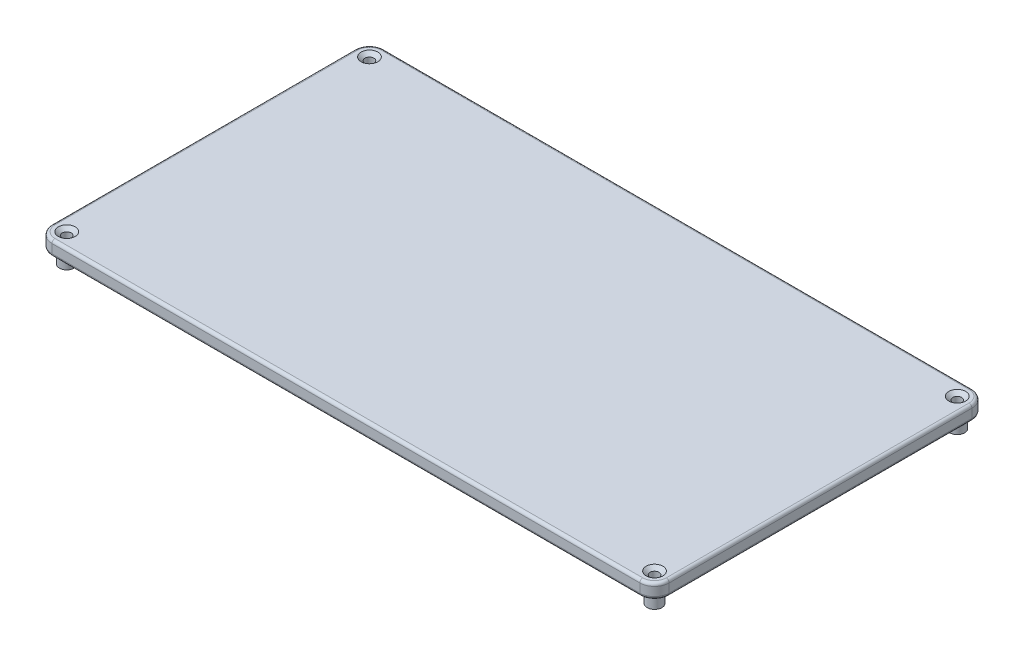
ISO-10303-21;
HEADER;
FILE_DESCRIPTION(('STEP AP214'),'2;1');
FILE_NAME('part.step','',(''),(''),'','','');
FILE_SCHEMA(('AUTOMOTIVE_DESIGN { 1 0 10303 214 1 1 1 1 }'));
ENDSEC;
DATA;
#1=APPLICATION_CONTEXT('core data for automotive mechanical design processes');
#2=APPLICATION_PROTOCOL_DEFINITION('international standard','automotive_design',2000,#1);
#3=PRODUCT_CONTEXT('',#1,'mechanical');
#4=PRODUCT('Part','Part','',(#3));
#5=PRODUCT_RELATED_PRODUCT_CATEGORY('part','',(#4));
#6=PRODUCT_DEFINITION_FORMATION('','',#4);
#7=PRODUCT_DEFINITION_CONTEXT('part definition',#1,'design');
#8=PRODUCT_DEFINITION('design','',#6,#7);
#9=PRODUCT_DEFINITION_SHAPE('','',#8);
#10=(LENGTH_UNIT() NAMED_UNIT(*) SI_UNIT(.MILLI.,.METRE.));
#11=(NAMED_UNIT(*) PLANE_ANGLE_UNIT() SI_UNIT($,.RADIAN.));
#12=(NAMED_UNIT(*) SI_UNIT($,.STERADIAN.) SOLID_ANGLE_UNIT());
#13=UNCERTAINTY_MEASURE_WITH_UNIT(LENGTH_MEASURE(1.E-05),#10,'distance_accuracy_value','');
#14=(GEOMETRIC_REPRESENTATION_CONTEXT(3) GLOBAL_UNCERTAINTY_ASSIGNED_CONTEXT((#13)) GLOBAL_UNIT_ASSIGNED_CONTEXT((#10,
#11,#12)) REPRESENTATION_CONTEXT('',''));
#15=CARTESIAN_POINT('',(0.,0.,0.));
#16=DIRECTION('',(0.,0.,1.));
#17=DIRECTION('',(1.,0.,0.));
#18=AXIS2_PLACEMENT_3D('',#15,#16,#17);
#19=CARTESIAN_POINT('',(105.,5.,56.5));
#20=DIRECTION('',(-1.,0.,0.));
#21=DIRECTION('',(0.,0.,1.));
#22=AXIS2_PLACEMENT_3D('',#19,#20,#21);
#23=PLANE('',#22);
#24=DIRECTION('',(0.,-1.,0.));
#25=VECTOR('',#24,1.);
#26=CARTESIAN_POINT('',(105.,5.,-51.5));
#27=LINE('',#26,#25);
#28=CARTESIAN_POINT('',(105.,1.,-51.5));
#29=VERTEX_POINT('',#28);
#30=CARTESIAN_POINT('',(105.,4.,-51.5));
#31=VERTEX_POINT('',#30);
#32=EDGE_CURVE('E280',#29,#31,#27,.F.);
#33=ORIENTED_EDGE('',*,*,#32,.T.);
#34=DIRECTION('',(0.,0.,-1.));
#35=VECTOR('',#34,1.);
#36=CARTESIAN_POINT('',(105.,4.,56.5));
#37=LINE('',#36,#35);
#38=CARTESIAN_POINT('',(105.,4.,51.5));
#39=VERTEX_POINT('',#38);
#40=EDGE_CURVE('E202',#31,#39,#37,.F.);
#41=ORIENTED_EDGE('',*,*,#40,.T.);
#42=DIRECTION('',(0.,-1.,0.));
#43=VECTOR('',#42,1.);
#44=CARTESIAN_POINT('',(105.,5.,51.5));
#45=LINE('',#44,#43);
#46=CARTESIAN_POINT('',(105.,1.,51.5));
#47=VERTEX_POINT('',#46);
#48=EDGE_CURVE('E169',#39,#47,#45,.T.);
#49=ORIENTED_EDGE('',*,*,#48,.T.);
#50=DIRECTION('',(0.,0.,-1.));
#51=VECTOR('',#50,1.);
#52=CARTESIAN_POINT('',(105.,1.,-51.5));
#53=LINE('',#52,#51);
#54=EDGE_CURVE('E200',#47,#29,#53,.T.);
#55=ORIENTED_EDGE('',*,*,#54,.T.);
#56=EDGE_LOOP('',(#33,#41,#49,#55));
#57=FACE_BOUND('',#56,.T.);
#58=ADVANCED_FACE('F32',(#57),#23,.F.);
#59=CARTESIAN_POINT('',(-105.,5.,-56.5));
#60=DIRECTION('',(0.,0.,1.));
#61=DIRECTION('',(1.,0.,0.));
#62=AXIS2_PLACEMENT_3D('',#59,#60,#61);
#63=PLANE('',#62);
#64=DIRECTION('',(0.,-1.,0.));
#65=VECTOR('',#64,1.);
#66=CARTESIAN_POINT('',(-100.,5.,-56.5));
#67=LINE('',#66,#65);
#68=CARTESIAN_POINT('',(-100.,1.,-56.5));
#69=VERTEX_POINT('',#68);
#70=CARTESIAN_POINT('',(-100.,4.,-56.5));
#71=VERTEX_POINT('',#70);
#72=EDGE_CURVE('E286',#69,#71,#67,.F.);
#73=ORIENTED_EDGE('',*,*,#72,.T.);
#74=DIRECTION('',(-1.,0.,0.));
#75=VECTOR('',#74,1.);
#76=CARTESIAN_POINT('',(-105.,4.,-56.5));
#77=LINE('',#76,#75);
#78=CARTESIAN_POINT('',(100.,4.,-56.5));
#79=VERTEX_POINT('',#78);
#80=EDGE_CURVE('E194',#71,#79,#77,.F.);
#81=ORIENTED_EDGE('',*,*,#80,.T.);
#82=DIRECTION('',(0.,-1.,0.));
#83=VECTOR('',#82,1.);
#84=CARTESIAN_POINT('',(100.,5.,-56.5));
#85=LINE('',#84,#83);
#86=CARTESIAN_POINT('',(100.,1.,-56.5));
#87=VERTEX_POINT('',#86);
#88=EDGE_CURVE('E277',#79,#87,#85,.T.);
#89=ORIENTED_EDGE('',*,*,#88,.T.);
#90=DIRECTION('',(-1.,0.,0.));
#91=VECTOR('',#90,1.);
#92=CARTESIAN_POINT('',(-100.,1.,-56.5));
#93=LINE('',#92,#91);
#94=EDGE_CURVE('E192',#87,#69,#93,.T.);
#95=ORIENTED_EDGE('',*,*,#94,.T.);
#96=EDGE_LOOP('',(#73,#81,#89,#95));
#97=FACE_BOUND('',#96,.T.);
#98=ADVANCED_FACE('F283',(#97),#63,.F.);
#99=CARTESIAN_POINT('',(-105.,5.,56.5));
#100=DIRECTION('',(1.,0.,0.));
#101=DIRECTION('',(0.,0.,-1.));
#102=AXIS2_PLACEMENT_3D('',#99,#100,#101);
#103=PLANE('',#102);
#104=DIRECTION('',(0.,-1.,0.));
#105=VECTOR('',#104,1.);
#106=CARTESIAN_POINT('',(-105.,5.,51.5));
#107=LINE('',#106,#105);
#108=CARTESIAN_POINT('',(-105.,1.,51.5));
#109=VERTEX_POINT('',#108);
#110=CARTESIAN_POINT('',(-105.,4.,51.5));
#111=VERTEX_POINT('',#110);
#112=EDGE_CURVE('E241',#109,#111,#107,.F.);
#113=ORIENTED_EDGE('',*,*,#112,.T.);
#114=DIRECTION('',(0.,0.,1.));
#115=VECTOR('',#114,1.);
#116=CARTESIAN_POINT('',(-105.,4.,56.5));
#117=LINE('',#116,#115);
#118=CARTESIAN_POINT('',(-105.,4.,-51.5));
#119=VERTEX_POINT('',#118);
#120=EDGE_CURVE('E186',#111,#119,#117,.F.);
#121=ORIENTED_EDGE('',*,*,#120,.T.);
#122=DIRECTION('',(0.,-1.,0.));
#123=VECTOR('',#122,1.);
#124=CARTESIAN_POINT('',(-105.,5.,-51.5));
#125=LINE('',#124,#123);
#126=CARTESIAN_POINT('',(-105.,1.,-51.5));
#127=VERTEX_POINT('',#126);
#128=EDGE_CURVE('E287',#119,#127,#125,.T.);
#129=ORIENTED_EDGE('',*,*,#128,.T.);
#130=DIRECTION('',(0.,0.,1.));
#131=VECTOR('',#130,1.);
#132=CARTESIAN_POINT('',(-105.,1.,51.5));
#133=LINE('',#132,#131);
#134=EDGE_CURVE('E184',#127,#109,#133,.T.);
#135=ORIENTED_EDGE('',*,*,#134,.T.);
#136=EDGE_LOOP('',(#113,#121,#129,#135));
#137=FACE_BOUND('',#136,.T.);
#138=ADVANCED_FACE('F326',(#137),#103,.F.);
#139=CARTESIAN_POINT('',(-105.,5.,56.5));
#140=DIRECTION('',(0.,0.,-1.));
#141=DIRECTION('',(-1.,0.,0.));
#142=AXIS2_PLACEMENT_3D('',#139,#140,#141);
#143=PLANE('',#142);
#144=DIRECTION('',(0.,-1.,0.));
#145=VECTOR('',#144,1.);
#146=CARTESIAN_POINT('',(100.,5.,56.5));
#147=LINE('',#146,#145);
#148=CARTESIAN_POINT('',(100.,1.,56.5));
#149=VERTEX_POINT('',#148);
#150=CARTESIAN_POINT('',(100.,4.,56.5));
#151=VERTEX_POINT('',#150);
#152=EDGE_CURVE('E289',#149,#151,#147,.F.);
#153=ORIENTED_EDGE('',*,*,#152,.T.);
#154=DIRECTION('',(1.,0.,0.));
#155=VECTOR('',#154,1.);
#156=CARTESIAN_POINT('',(-105.,4.,56.5));
#157=LINE('',#156,#155);
#158=CARTESIAN_POINT('',(-100.,4.,56.5));
#159=VERTEX_POINT('',#158);
#160=EDGE_CURVE('E11',#151,#159,#157,.F.);
#161=ORIENTED_EDGE('',*,*,#160,.T.);
#162=DIRECTION('',(0.,-1.,0.));
#163=VECTOR('',#162,1.);
#164=CARTESIAN_POINT('',(-100.,5.,56.5));
#165=LINE('',#164,#163);
#166=CARTESIAN_POINT('',(-100.,1.,56.5));
#167=VERTEX_POINT('',#166);
#168=EDGE_CURVE('E297',#159,#167,#165,.T.);
#169=ORIENTED_EDGE('',*,*,#168,.T.);
#170=DIRECTION('',(1.,0.,0.));
#171=VECTOR('',#170,1.);
#172=CARTESIAN_POINT('',(100.,1.,56.5));
#173=LINE('',#172,#171);
#174=EDGE_CURVE('E41',#167,#149,#173,.T.);
#175=ORIENTED_EDGE('',*,*,#174,.T.);
#176=EDGE_LOOP('',(#153,#161,#169,#175));
#177=FACE_BOUND('',#176,.T.);
#178=ADVANCED_FACE('F573',(#177),#143,.F.);
#179=CARTESIAN_POINT('',(0.,5.,0.));
#180=DIRECTION('',(0.,-1.,0.));
#181=DIRECTION('',(0.,0.,-1.));
#182=AXIS2_PLACEMENT_3D('',#179,#180,#181);
#183=PLANE('',#182);
#184=CARTESIAN_POINT('',(-100.,5.,51.5));
#185=DIRECTION('',(0.,1.,0.));
#186=DIRECTION('',(0.,0.,1.));
#187=AXIS2_PLACEMENT_3D('',#184,#185,#186);
#188=CIRCLE('',#187,2.8575);
#189=CARTESIAN_POINT('',(-100.,5.,54.3575));
#190=VERTEX_POINT('',#189);
#191=EDGE_CURVE('E337',#190,#190,#188,.T.);
#192=ORIENTED_EDGE('',*,*,#191,.F.);
#193=EDGE_LOOP('',(#192));
#194=FACE_BOUND('',#193,.T.);
#195=CARTESIAN_POINT('',(100.,5.,-51.5));
#196=DIRECTION('',(0.,1.,0.));
#197=DIRECTION('',(0.,0.,1.));
#198=AXIS2_PLACEMENT_3D('',#195,#196,#197);
#199=CIRCLE('',#198,2.8575);
#200=CARTESIAN_POINT('',(100.,5.,-48.6425));
#201=VERTEX_POINT('',#200);
#202=EDGE_CURVE('E334',#201,#201,#199,.T.);
#203=ORIENTED_EDGE('',*,*,#202,.F.);
#204=EDGE_LOOP('',(#203));
#205=FACE_BOUND('',#204,.T.);
#206=CARTESIAN_POINT('',(100.,5.,51.5));
#207=DIRECTION('',(0.,1.,0.));
#208=DIRECTION('',(0.,0.,1.));
#209=AXIS2_PLACEMENT_3D('',#206,#207,#208);
#210=CIRCLE('',#209,2.8575);
#211=CARTESIAN_POINT('',(100.,5.,54.3575));
#212=VERTEX_POINT('',#211);
#213=EDGE_CURVE('E331',#212,#212,#210,.T.);
#214=ORIENTED_EDGE('',*,*,#213,.F.);
#215=EDGE_LOOP('',(#214));
#216=FACE_BOUND('',#215,.T.);
#217=CARTESIAN_POINT('',(-100.,5.,-51.5));
#218=DIRECTION('',(0.,1.,0.));
#219=DIRECTION('',(0.,0.,1.));
#220=AXIS2_PLACEMENT_3D('',#217,#218,#219);
#221=CIRCLE('',#220,2.8575);
#222=CARTESIAN_POINT('',(-100.,5.,-48.6425));
#223=VERTEX_POINT('',#222);
#224=EDGE_CURVE('E244',#223,#223,#221,.T.);
#225=ORIENTED_EDGE('',*,*,#224,.F.);
#226=EDGE_LOOP('',(#225));
#227=FACE_BOUND('',#226,.T.);
#228=DIRECTION('',(0.,0.,1.));
#229=VECTOR('',#228,1.);
#230=CARTESIAN_POINT('',(-104.,5.,0.));
#231=LINE('',#230,#229);
#232=CARTESIAN_POINT('',(-104.,5.,-51.5));
#233=VERTEX_POINT('',#232);
#234=CARTESIAN_POINT('',(-104.,5.,51.5));
#235=VERTEX_POINT('',#234);
#236=EDGE_CURVE('E173',#233,#235,#231,.T.);
#237=ORIENTED_EDGE('',*,*,#236,.T.);
#238=CARTESIAN_POINT('',(-100.,5.,51.5));
#239=DIRECTION('',(0.,-1.,0.));
#240=DIRECTION('',(0.,0.,-1.));
#241=AXIS2_PLACEMENT_3D('',#238,#239,#240);
#242=CIRCLE('',#241,4.);
#243=CARTESIAN_POINT('',(-100.,5.,55.5));
#244=VERTEX_POINT('',#243);
#245=EDGE_CURVE('E153',#235,#244,#242,.F.);
#246=ORIENTED_EDGE('',*,*,#245,.T.);
#247=DIRECTION('',(1.,0.,0.));
#248=VECTOR('',#247,1.);
#249=CARTESIAN_POINT('',(0.,5.,55.5));
#250=LINE('',#249,#248);
#251=CARTESIAN_POINT('',(100.,5.,55.5));
#252=VERTEX_POINT('',#251);
#253=EDGE_CURVE('E162',#244,#252,#250,.T.);
#254=ORIENTED_EDGE('',*,*,#253,.T.);
#255=CARTESIAN_POINT('',(100.,5.,51.5));
#256=DIRECTION('',(0.,-1.,0.));
#257=DIRECTION('',(0.,0.,-1.));
#258=AXIS2_PLACEMENT_3D('',#255,#256,#257);
#259=CIRCLE('',#258,4.);
#260=CARTESIAN_POINT('',(104.,5.,51.5));
#261=VERTEX_POINT('',#260);
#262=EDGE_CURVE('E168',#252,#261,#259,.F.);
#263=ORIENTED_EDGE('',*,*,#262,.T.);
#264=DIRECTION('',(0.,0.,-1.));
#265=VECTOR('',#264,1.);
#266=CARTESIAN_POINT('',(104.,5.,0.));
#267=LINE('',#266,#265);
#268=CARTESIAN_POINT('',(104.,5.,-51.5));
#269=VERTEX_POINT('',#268);
#270=EDGE_CURVE('E304',#261,#269,#267,.T.);
#271=ORIENTED_EDGE('',*,*,#270,.T.);
#272=CARTESIAN_POINT('',(100.,5.,-51.5));
#273=DIRECTION('',(0.,-1.,0.));
#274=DIRECTION('',(0.,0.,-1.));
#275=AXIS2_PLACEMENT_3D('',#272,#273,#274);
#276=CIRCLE('',#275,4.);
#277=CARTESIAN_POINT('',(100.,5.,-55.5));
#278=VERTEX_POINT('',#277);
#279=EDGE_CURVE('E306',#269,#278,#276,.F.);
#280=ORIENTED_EDGE('',*,*,#279,.T.);
#281=DIRECTION('',(-1.,0.,0.));
#282=VECTOR('',#281,1.);
#283=CARTESIAN_POINT('',(0.,5.,-55.5));
#284=LINE('',#283,#282);
#285=CARTESIAN_POINT('',(-100.,5.,-55.5));
#286=VERTEX_POINT('',#285);
#287=EDGE_CURVE('E308',#278,#286,#284,.T.);
#288=ORIENTED_EDGE('',*,*,#287,.T.);
#289=CARTESIAN_POINT('',(-100.,5.,-51.5));
#290=DIRECTION('',(0.,-1.,0.));
#291=DIRECTION('',(0.,0.,-1.));
#292=AXIS2_PLACEMENT_3D('',#289,#290,#291);
#293=CIRCLE('',#292,4.);
#294=EDGE_CURVE('E179',#286,#233,#293,.F.);
#295=ORIENTED_EDGE('',*,*,#294,.T.);
#296=EDGE_LOOP('',(#237,#246,#254,#263,#271,#280,#288,#295));
#297=FACE_BOUND('',#296,.T.);
#298=ADVANCED_FACE('F171',(#194,#205,#216,#227,#297),#183,.F.);
#299=CARTESIAN_POINT('',(0.,0.,0.));
#300=DIRECTION('',(0.,-1.,0.));
#301=DIRECTION('',(0.,0.,-1.));
#302=AXIS2_PLACEMENT_3D('',#299,#300,#301);
#303=PLANE('',#302);
#304=CARTESIAN_POINT('',(100.,0.,-51.5));
#305=DIRECTION('',(0.,-1.,0.));
#306=DIRECTION('',(0.,0.,-1.));
#307=AXIS2_PLACEMENT_3D('',#304,#305,#306);
#308=CIRCLE('',#307,2.52499999999999);
#309=CARTESIAN_POINT('',(100.,0.,-54.025));
#310=VERTEX_POINT('',#309);
#311=EDGE_CURVE('E374',#310,#310,#308,.T.);
#312=ORIENTED_EDGE('',*,*,#311,.F.);
#313=EDGE_LOOP('',(#312));
#314=FACE_BOUND('',#313,.T.);
#315=CARTESIAN_POINT('',(100.,0.,51.5));
#316=DIRECTION('',(0.,-1.,0.));
#317=DIRECTION('',(0.,0.,-1.));
#318=AXIS2_PLACEMENT_3D('',#315,#316,#317);
#319=CIRCLE('',#318,2.52499999999999);
#320=CARTESIAN_POINT('',(100.,0.,48.975));
#321=VERTEX_POINT('',#320);
#322=EDGE_CURVE('E362',#321,#321,#319,.T.);
#323=ORIENTED_EDGE('',*,*,#322,.F.);
#324=EDGE_LOOP('',(#323));
#325=FACE_BOUND('',#324,.T.);
#326=CARTESIAN_POINT('',(-100.,0.,-51.5));
#327=DIRECTION('',(0.,-1.,0.));
#328=DIRECTION('',(0.,0.,-1.));
#329=AXIS2_PLACEMENT_3D('',#326,#327,#328);
#330=CIRCLE('',#329,2.52499999999999);
#331=CARTESIAN_POINT('',(-100.,0.,-54.025));
#332=VERTEX_POINT('',#331);
#333=EDGE_CURVE('E349',#332,#332,#330,.T.);
#334=ORIENTED_EDGE('',*,*,#333,.F.);
#335=EDGE_LOOP('',(#334));
#336=FACE_BOUND('',#335,.T.);
#337=CARTESIAN_POINT('',(-100.,0.,51.5));
#338=DIRECTION('',(0.,-1.,0.));
#339=DIRECTION('',(0.,0.,-1.));
#340=AXIS2_PLACEMENT_3D('',#337,#338,#339);
#341=CIRCLE('',#340,2.4732);
#342=CARTESIAN_POINT('',(-100.,0.,49.0268));
#343=VERTEX_POINT('',#342);
#344=EDGE_CURVE('E341',#343,#343,#341,.T.);
#345=ORIENTED_EDGE('',*,*,#344,.F.);
#346=EDGE_LOOP('',(#345));
#347=FACE_BOUND('',#346,.T.);
#348=DIRECTION('',(1.,0.,0.));
#349=VECTOR('',#348,1.);
#350=CARTESIAN_POINT('',(-100.,0.,55.5));
#351=LINE('',#350,#349);
#352=CARTESIAN_POINT('',(100.,0.,55.5));
#353=VERTEX_POINT('',#352);
#354=CARTESIAN_POINT('',(-100.,0.,55.5));
#355=VERTEX_POINT('',#354);
#356=EDGE_CURVE('E208',#353,#355,#351,.F.);
#357=ORIENTED_EDGE('',*,*,#356,.T.);
#358=CARTESIAN_POINT('',(-100.,0.,51.5));
#359=DIRECTION('',(0.,-1.,0.));
#360=DIRECTION('',(0.,0.,-1.));
#361=AXIS2_PLACEMENT_3D('',#358,#359,#360);
#362=CIRCLE('',#361,4.);
#363=CARTESIAN_POINT('',(-104.,0.,51.5));
#364=VERTEX_POINT('',#363);
#365=EDGE_CURVE('E221',#355,#364,#362,.T.);
#366=ORIENTED_EDGE('',*,*,#365,.T.);
#367=DIRECTION('',(0.,0.,1.));
#368=VECTOR('',#367,1.);
#369=CARTESIAN_POINT('',(-104.,0.,-51.5));
#370=LINE('',#369,#368);
#371=CARTESIAN_POINT('',(-104.,0.,-51.5));
#372=VERTEX_POINT('',#371);
#373=EDGE_CURVE('E56',#364,#372,#370,.F.);
#374=ORIENTED_EDGE('',*,*,#373,.T.);
#375=CARTESIAN_POINT('',(-100.,0.,-51.5));
#376=DIRECTION('',(0.,-1.,0.));
#377=DIRECTION('',(0.,0.,-1.));
#378=AXIS2_PLACEMENT_3D('',#375,#376,#377);
#379=CIRCLE('',#378,4.);
#380=CARTESIAN_POINT('',(-100.,0.,-55.5));
#381=VERTEX_POINT('',#380);
#382=EDGE_CURVE('E218',#372,#381,#379,.T.);
#383=ORIENTED_EDGE('',*,*,#382,.T.);
#384=DIRECTION('',(-1.,0.,0.));
#385=VECTOR('',#384,1.);
#386=CARTESIAN_POINT('',(100.,0.,-55.5));
#387=LINE('',#386,#385);
#388=CARTESIAN_POINT('',(100.,0.,-55.5));
#389=VERTEX_POINT('',#388);
#390=EDGE_CURVE('E216',#381,#389,#387,.F.);
#391=ORIENTED_EDGE('',*,*,#390,.T.);
#392=CARTESIAN_POINT('',(100.,0.,-51.5));
#393=DIRECTION('',(0.,-1.,0.));
#394=DIRECTION('',(0.,0.,-1.));
#395=AXIS2_PLACEMENT_3D('',#392,#393,#394);
#396=CIRCLE('',#395,4.);
#397=CARTESIAN_POINT('',(104.,0.,-51.5));
#398=VERTEX_POINT('',#397);
#399=EDGE_CURVE('E214',#389,#398,#396,.T.);
#400=ORIENTED_EDGE('',*,*,#399,.T.);
#401=DIRECTION('',(0.,0.,-1.));
#402=VECTOR('',#401,1.);
#403=CARTESIAN_POINT('',(104.,0.,51.5));
#404=LINE('',#403,#402);
#405=CARTESIAN_POINT('',(104.,0.,51.5));
#406=VERTEX_POINT('',#405);
#407=EDGE_CURVE('E212',#398,#406,#404,.F.);
#408=ORIENTED_EDGE('',*,*,#407,.T.);
#409=CARTESIAN_POINT('',(100.,0.,51.5));
#410=DIRECTION('',(0.,-1.,0.));
#411=DIRECTION('',(0.,0.,-1.));
#412=AXIS2_PLACEMENT_3D('',#409,#410,#411);
#413=CIRCLE('',#412,4.);
#414=EDGE_CURVE('E210',#406,#353,#413,.T.);
#415=ORIENTED_EDGE('',*,*,#414,.T.);
#416=EDGE_LOOP('',(#357,#366,#374,#383,#391,#400,#408,#415));
#417=FACE_BOUND('',#416,.T.);
#418=ADVANCED_FACE('F402',(#314,#325,#336,#347,#417),#303,.T.);
#419=CARTESIAN_POINT('',(-100.,5.,-51.5));
#420=DIRECTION('',(0.,-1.,0.));
#421=DIRECTION('',(0.,0.,-1.));
#422=AXIS2_PLACEMENT_3D('',#419,#420,#421);
#423=CYLINDRICAL_SURFACE('',#422,5.);
#424=ORIENTED_EDGE('',*,*,#128,.F.);
#425=CARTESIAN_POINT('',(-100.,4.,-51.5));
#426=DIRECTION('',(0.,-1.,0.));
#427=DIRECTION('',(0.,0.,-1.));
#428=AXIS2_PLACEMENT_3D('',#425,#426,#427);
#429=CIRCLE('',#428,5.);
#430=EDGE_CURVE('E190',#119,#71,#429,.T.);
#431=ORIENTED_EDGE('',*,*,#430,.T.);
#432=ORIENTED_EDGE('',*,*,#72,.F.);
#433=CARTESIAN_POINT('',(-100.,1.,-51.5));
#434=DIRECTION('',(0.,-1.,0.));
#435=DIRECTION('',(0.,0.,-1.));
#436=AXIS2_PLACEMENT_3D('',#433,#434,#435);
#437=CIRCLE('',#436,5.);
#438=EDGE_CURVE('E188',#69,#127,#437,.F.);
#439=ORIENTED_EDGE('',*,*,#438,.T.);
#440=EDGE_LOOP('',(#424,#431,#432,#439));
#441=FACE_BOUND('',#440,.T.);
#442=ADVANCED_FACE('F405',(#441),#423,.T.);
#443=CARTESIAN_POINT('',(-100.,5.,51.5));
#444=DIRECTION('',(0.,-1.,0.));
#445=DIRECTION('',(0.,0.,-1.));
#446=AXIS2_PLACEMENT_3D('',#443,#444,#445);
#447=CYLINDRICAL_SURFACE('',#446,5.);
#448=ORIENTED_EDGE('',*,*,#168,.F.);
#449=CARTESIAN_POINT('',(-100.,4.,51.5));
#450=DIRECTION('',(0.,-1.,0.));
#451=DIRECTION('',(0.,0.,-1.));
#452=AXIS2_PLACEMENT_3D('',#449,#450,#451);
#453=CIRCLE('',#452,5.);
#454=EDGE_CURVE('E155',#159,#111,#453,.T.);
#455=ORIENTED_EDGE('',*,*,#454,.T.);
#456=ORIENTED_EDGE('',*,*,#112,.F.);
#457=CARTESIAN_POINT('',(-100.,1.,51.5));
#458=DIRECTION('',(0.,-1.,0.));
#459=DIRECTION('',(0.,0.,-1.));
#460=AXIS2_PLACEMENT_3D('',#457,#458,#459);
#461=CIRCLE('',#460,5.);
#462=EDGE_CURVE('E175',#109,#167,#461,.F.);
#463=ORIENTED_EDGE('',*,*,#462,.T.);
#464=EDGE_LOOP('',(#448,#455,#456,#463));
#465=FACE_BOUND('',#464,.T.);
#466=ADVANCED_FACE('F325',(#465),#447,.T.);
#467=CARTESIAN_POINT('',(100.,5.,51.5));
#468=DIRECTION('',(0.,-1.,0.));
#469=DIRECTION('',(0.,0.,-1.));
#470=AXIS2_PLACEMENT_3D('',#467,#468,#469);
#471=CYLINDRICAL_SURFACE('',#470,5.);
#472=ORIENTED_EDGE('',*,*,#48,.F.);
#473=CARTESIAN_POINT('',(100.,4.,51.5));
#474=DIRECTION('',(0.,-1.,0.));
#475=DIRECTION('',(0.,0.,-1.));
#476=AXIS2_PLACEMENT_3D('',#473,#474,#475);
#477=CIRCLE('',#476,5.);
#478=EDGE_CURVE('E206',#39,#151,#477,.T.);
#479=ORIENTED_EDGE('',*,*,#478,.T.);
#480=ORIENTED_EDGE('',*,*,#152,.F.);
#481=CARTESIAN_POINT('',(100.,1.,51.5));
#482=DIRECTION('',(0.,-1.,0.));
#483=DIRECTION('',(0.,0.,-1.));
#484=AXIS2_PLACEMENT_3D('',#481,#482,#483);
#485=CIRCLE('',#484,5.);
#486=EDGE_CURVE('E204',#149,#47,#485,.F.);
#487=ORIENTED_EDGE('',*,*,#486,.T.);
#488=EDGE_LOOP('',(#472,#479,#480,#487));
#489=FACE_BOUND('',#488,.T.);
#490=ADVANCED_FACE('F449',(#489),#471,.T.);
#491=CARTESIAN_POINT('',(100.,5.,-51.5));
#492=DIRECTION('',(0.,-1.,0.));
#493=DIRECTION('',(0.,0.,-1.));
#494=AXIS2_PLACEMENT_3D('',#491,#492,#493);
#495=CYLINDRICAL_SURFACE('',#494,5.);
#496=ORIENTED_EDGE('',*,*,#88,.F.);
#497=CARTESIAN_POINT('',(100.,4.,-51.5));
#498=DIRECTION('',(0.,-1.,0.));
#499=DIRECTION('',(0.,0.,-1.));
#500=AXIS2_PLACEMENT_3D('',#497,#498,#499);
#501=CIRCLE('',#500,5.);
#502=EDGE_CURVE('E198',#79,#31,#501,.T.);
#503=ORIENTED_EDGE('',*,*,#502,.T.);
#504=ORIENTED_EDGE('',*,*,#32,.F.);
#505=CARTESIAN_POINT('',(100.,1.,-51.5));
#506=DIRECTION('',(0.,-1.,0.));
#507=DIRECTION('',(0.,0.,-1.));
#508=AXIS2_PLACEMENT_3D('',#505,#506,#507);
#509=CIRCLE('',#508,5.);
#510=EDGE_CURVE('E196',#29,#87,#509,.F.);
#511=ORIENTED_EDGE('',*,*,#510,.T.);
#512=EDGE_LOOP('',(#496,#503,#504,#511));
#513=FACE_BOUND('',#512,.T.);
#514=ADVANCED_FACE('F276',(#513),#495,.T.);
#515=CARTESIAN_POINT('',(100.,4.,-51.5));
#516=DIRECTION('',(0.,-1.,0.));
#517=DIRECTION('',(0.,0.,-1.));
#518=AXIS2_PLACEMENT_3D('',#515,#516,#517);
#519=TOROIDAL_SURFACE('',#518,4.,1.);
#520=CARTESIAN_POINT('',(104.,4.,-51.5));
#521=DIRECTION('',(0.,0.,1.));
#522=DIRECTION('',(1.,0.,0.));
#523=AXIS2_PLACEMENT_3D('',#520,#521,#522);
#524=CIRCLE('',#523,1.);
#525=EDGE_CURVE('E235',#31,#269,#524,.T.);
#526=ORIENTED_EDGE('',*,*,#525,.F.);
#527=ORIENTED_EDGE('',*,*,#502,.F.);
#528=CARTESIAN_POINT('',(100.,4.,-55.5));
#529=DIRECTION('',(-1.,0.,0.));
#530=DIRECTION('',(0.,0.,1.));
#531=AXIS2_PLACEMENT_3D('',#528,#529,#530);
#532=CIRCLE('',#531,1.);
#533=EDGE_CURVE('E238',#278,#79,#532,.T.);
#534=ORIENTED_EDGE('',*,*,#533,.F.);
#535=ORIENTED_EDGE('',*,*,#279,.F.);
#536=EDGE_LOOP('',(#526,#527,#534,#535));
#537=FACE_BOUND('',#536,.T.);
#538=ADVANCED_FACE('F455',(#537),#519,.T.);
#539=CARTESIAN_POINT('',(0.,4.,-55.5));
#540=DIRECTION('',(-1.,0.,0.));
#541=DIRECTION('',(0.,0.,1.));
#542=AXIS2_PLACEMENT_3D('',#539,#540,#541);
#543=CYLINDRICAL_SURFACE('',#542,1.);
#544=ORIENTED_EDGE('',*,*,#533,.T.);
#545=ORIENTED_EDGE('',*,*,#80,.F.);
#546=CARTESIAN_POINT('',(-100.,4.,-55.5));
#547=DIRECTION('',(-1.,0.,0.));
#548=DIRECTION('',(0.,0.,1.));
#549=AXIS2_PLACEMENT_3D('',#546,#547,#548);
#550=CIRCLE('',#549,1.);
#551=EDGE_CURVE('E232',#286,#71,#550,.T.);
#552=ORIENTED_EDGE('',*,*,#551,.F.);
#553=ORIENTED_EDGE('',*,*,#287,.F.);
#554=EDGE_LOOP('',(#544,#545,#552,#553));
#555=FACE_BOUND('',#554,.T.);
#556=ADVANCED_FACE('F471',(#555),#543,.T.);
#557=CARTESIAN_POINT('',(104.,4.,0.));
#558=DIRECTION('',(0.,0.,-1.));
#559=DIRECTION('',(-1.,0.,0.));
#560=AXIS2_PLACEMENT_3D('',#557,#558,#559);
#561=CYLINDRICAL_SURFACE('',#560,1.);
#562=ORIENTED_EDGE('',*,*,#525,.T.);
#563=ORIENTED_EDGE('',*,*,#270,.F.);
#564=CARTESIAN_POINT('',(104.,4.,51.5));
#565=DIRECTION('',(0.,0.,1.));
#566=DIRECTION('',(1.,0.,0.));
#567=AXIS2_PLACEMENT_3D('',#564,#565,#566);
#568=CIRCLE('',#567,1.);
#569=EDGE_CURVE('E229',#39,#261,#568,.T.);
#570=ORIENTED_EDGE('',*,*,#569,.F.);
#571=ORIENTED_EDGE('',*,*,#40,.F.);
#572=EDGE_LOOP('',(#562,#563,#570,#571));
#573=FACE_BOUND('',#572,.T.);
#574=ADVANCED_FACE('F468',(#573),#561,.T.);
#575=CARTESIAN_POINT('',(-100.,4.,-51.5));
#576=DIRECTION('',(0.,-1.,0.));
#577=DIRECTION('',(0.,0.,-1.));
#578=AXIS2_PLACEMENT_3D('',#575,#576,#577);
#579=TOROIDAL_SURFACE('',#578,4.,1.);
#580=ORIENTED_EDGE('',*,*,#551,.T.);
#581=ORIENTED_EDGE('',*,*,#430,.F.);
#582=CARTESIAN_POINT('',(-104.,4.,-51.5));
#583=DIRECTION('',(0.,0.,1.));
#584=DIRECTION('',(1.,0.,0.));
#585=AXIS2_PLACEMENT_3D('',#582,#583,#584);
#586=CIRCLE('',#585,1.);
#587=EDGE_CURVE('E226',#233,#119,#586,.T.);
#588=ORIENTED_EDGE('',*,*,#587,.F.);
#589=ORIENTED_EDGE('',*,*,#294,.F.);
#590=EDGE_LOOP('',(#580,#581,#588,#589));
#591=FACE_BOUND('',#590,.T.);
#592=ADVANCED_FACE('F315',(#591),#579,.T.);
#593=CARTESIAN_POINT('',(100.,4.,51.5));
#594=DIRECTION('',(0.,-1.,0.));
#595=DIRECTION('',(0.,0.,-1.));
#596=AXIS2_PLACEMENT_3D('',#593,#594,#595);
#597=TOROIDAL_SURFACE('',#596,4.,1.);
#598=ORIENTED_EDGE('',*,*,#569,.T.);
#599=ORIENTED_EDGE('',*,*,#262,.F.);
#600=CARTESIAN_POINT('',(100.,4.,55.5));
#601=DIRECTION('',(-1.,0.,0.));
#602=DIRECTION('',(0.,0.,1.));
#603=AXIS2_PLACEMENT_3D('',#600,#601,#602);
#604=CIRCLE('',#603,1.);
#605=EDGE_CURVE('E165',#151,#252,#604,.T.);
#606=ORIENTED_EDGE('',*,*,#605,.F.);
#607=ORIENTED_EDGE('',*,*,#478,.F.);
#608=EDGE_LOOP('',(#598,#599,#606,#607));
#609=FACE_BOUND('',#608,.T.);
#610=ADVANCED_FACE('F462',(#609),#597,.T.);
#611=CARTESIAN_POINT('',(-104.,4.,0.));
#612=DIRECTION('',(0.,0.,1.));
#613=DIRECTION('',(1.,0.,0.));
#614=AXIS2_PLACEMENT_3D('',#611,#612,#613);
#615=CYLINDRICAL_SURFACE('',#614,1.);
#616=ORIENTED_EDGE('',*,*,#587,.T.);
#617=ORIENTED_EDGE('',*,*,#120,.F.);
#618=CARTESIAN_POINT('',(-104.,4.,51.5));
#619=DIRECTION('',(0.,0.,1.));
#620=DIRECTION('',(1.,0.,0.));
#621=AXIS2_PLACEMENT_3D('',#618,#619,#620);
#622=CIRCLE('',#621,1.);
#623=EDGE_CURVE('E158',#235,#111,#622,.T.);
#624=ORIENTED_EDGE('',*,*,#623,.F.);
#625=ORIENTED_EDGE('',*,*,#236,.F.);
#626=EDGE_LOOP('',(#616,#617,#624,#625));
#627=FACE_BOUND('',#626,.T.);
#628=ADVANCED_FACE('F318',(#627),#615,.T.);
#629=CARTESIAN_POINT('',(0.,4.,55.5));
#630=DIRECTION('',(1.,0.,0.));
#631=DIRECTION('',(0.,0.,-1.));
#632=AXIS2_PLACEMENT_3D('',#629,#630,#631);
#633=CYLINDRICAL_SURFACE('',#632,1.);
#634=ORIENTED_EDGE('',*,*,#605,.T.);
#635=ORIENTED_EDGE('',*,*,#253,.F.);
#636=CARTESIAN_POINT('',(-100.,4.,55.5));
#637=DIRECTION('',(-1.,0.,0.));
#638=DIRECTION('',(0.,0.,1.));
#639=AXIS2_PLACEMENT_3D('',#636,#637,#638);
#640=CIRCLE('',#639,1.);
#641=EDGE_CURVE('E149',#159,#244,#640,.T.);
#642=ORIENTED_EDGE('',*,*,#641,.F.);
#643=ORIENTED_EDGE('',*,*,#160,.F.);
#644=EDGE_LOOP('',(#634,#635,#642,#643));
#645=FACE_BOUND('',#644,.T.);
#646=ADVANCED_FACE('F163',(#645),#633,.T.);
#647=CARTESIAN_POINT('',(-100.,4.,51.5));
#648=DIRECTION('',(0.,-1.,0.));
#649=DIRECTION('',(0.,0.,-1.));
#650=AXIS2_PLACEMENT_3D('',#647,#648,#649);
#651=TOROIDAL_SURFACE('',#650,4.,1.);
#652=ORIENTED_EDGE('',*,*,#623,.T.);
#653=ORIENTED_EDGE('',*,*,#454,.F.);
#654=ORIENTED_EDGE('',*,*,#641,.T.);
#655=ORIENTED_EDGE('',*,*,#245,.F.);
#656=EDGE_LOOP('',(#652,#653,#654,#655));
#657=FACE_BOUND('',#656,.T.);
#658=ADVANCED_FACE('F151',(#657),#651,.T.);
#659=CARTESIAN_POINT('',(100.,1.,-51.5));
#660=DIRECTION('',(0.,-1.,0.));
#661=DIRECTION('',(0.,0.,-1.));
#662=AXIS2_PLACEMENT_3D('',#659,#660,#661);
#663=TOROIDAL_SURFACE('',#662,4.,1.);
#664=CARTESIAN_POINT('',(100.,1.,-55.5));
#665=DIRECTION('',(-1.,0.,0.));
#666=DIRECTION('',(0.,0.,1.));
#667=AXIS2_PLACEMENT_3D('',#664,#665,#666);
#668=CIRCLE('',#667,1.);
#669=EDGE_CURVE('E258',#87,#389,#668,.T.);
#670=ORIENTED_EDGE('',*,*,#669,.F.);
#671=ORIENTED_EDGE('',*,*,#510,.F.);
#672=CARTESIAN_POINT('',(104.,1.,-51.5));
#673=DIRECTION('',(0.,0.,1.));
#674=DIRECTION('',(1.,0.,0.));
#675=AXIS2_PLACEMENT_3D('',#672,#673,#674);
#676=CIRCLE('',#675,1.);
#677=EDGE_CURVE('E159',#398,#29,#676,.T.);
#678=ORIENTED_EDGE('',*,*,#677,.F.);
#679=ORIENTED_EDGE('',*,*,#399,.F.);
#680=EDGE_LOOP('',(#670,#671,#678,#679));
#681=FACE_BOUND('',#680,.T.);
#682=ADVANCED_FACE('F34',(#681),#663,.T.);
#683=CARTESIAN_POINT('',(104.,1.,56.5));
#684=DIRECTION('',(0.,0.,1.));
#685=DIRECTION('',(1.,0.,0.));
#686=AXIS2_PLACEMENT_3D('',#683,#684,#685);
#687=CYLINDRICAL_SURFACE('',#686,1.);
#688=ORIENTED_EDGE('',*,*,#677,.T.);
#689=ORIENTED_EDGE('',*,*,#54,.F.);
#690=CARTESIAN_POINT('',(104.,1.,51.5));
#691=DIRECTION('',(0.,0.,1.));
#692=DIRECTION('',(1.,0.,0.));
#693=AXIS2_PLACEMENT_3D('',#690,#691,#692);
#694=CIRCLE('',#693,1.);
#695=EDGE_CURVE('E255',#406,#47,#694,.T.);
#696=ORIENTED_EDGE('',*,*,#695,.F.);
#697=ORIENTED_EDGE('',*,*,#407,.F.);
#698=EDGE_LOOP('',(#688,#689,#696,#697));
#699=FACE_BOUND('',#698,.T.);
#700=ADVANCED_FACE('F265',(#699),#687,.T.);
#701=CARTESIAN_POINT('',(-105.,1.,-55.5));
#702=DIRECTION('',(1.,0.,0.));
#703=DIRECTION('',(0.,0.,-1.));
#704=AXIS2_PLACEMENT_3D('',#701,#702,#703);
#705=CYLINDRICAL_SURFACE('',#704,1.);
#706=ORIENTED_EDGE('',*,*,#669,.T.);
#707=ORIENTED_EDGE('',*,*,#390,.F.);
#708=CARTESIAN_POINT('',(-100.,1.,-55.5));
#709=DIRECTION('',(-1.,0.,0.));
#710=DIRECTION('',(0.,0.,1.));
#711=AXIS2_PLACEMENT_3D('',#708,#709,#710);
#712=CIRCLE('',#711,1.);
#713=EDGE_CURVE('E252',#69,#381,#712,.T.);
#714=ORIENTED_EDGE('',*,*,#713,.F.);
#715=ORIENTED_EDGE('',*,*,#94,.F.);
#716=EDGE_LOOP('',(#706,#707,#714,#715));
#717=FACE_BOUND('',#716,.T.);
#718=ADVANCED_FACE('F493',(#717),#705,.T.);
#719=CARTESIAN_POINT('',(100.,1.,51.5));
#720=DIRECTION('',(0.,-1.,0.));
#721=DIRECTION('',(0.,0.,-1.));
#722=AXIS2_PLACEMENT_3D('',#719,#720,#721);
#723=TOROIDAL_SURFACE('',#722,4.,1.);
#724=ORIENTED_EDGE('',*,*,#695,.T.);
#725=ORIENTED_EDGE('',*,*,#486,.F.);
#726=CARTESIAN_POINT('',(100.,1.,55.5));
#727=DIRECTION('',(-1.,0.,0.));
#728=DIRECTION('',(0.,0.,1.));
#729=AXIS2_PLACEMENT_3D('',#726,#727,#728);
#730=CIRCLE('',#729,1.);
#731=EDGE_CURVE('E249',#353,#149,#730,.T.);
#732=ORIENTED_EDGE('',*,*,#731,.F.);
#733=ORIENTED_EDGE('',*,*,#414,.F.);
#734=EDGE_LOOP('',(#724,#725,#732,#733));
#735=FACE_BOUND('',#734,.T.);
#736=ADVANCED_FACE('F490',(#735),#723,.T.);
#737=CARTESIAN_POINT('',(-100.,1.,-51.5));
#738=DIRECTION('',(0.,-1.,0.));
#739=DIRECTION('',(0.,0.,-1.));
#740=AXIS2_PLACEMENT_3D('',#737,#738,#739);
#741=TOROIDAL_SURFACE('',#740,4.,1.);
#742=ORIENTED_EDGE('',*,*,#713,.T.);
#743=ORIENTED_EDGE('',*,*,#382,.F.);
#744=CARTESIAN_POINT('',(-104.,1.,-51.5));
#745=DIRECTION('',(0.,0.,1.));
#746=DIRECTION('',(1.,0.,0.));
#747=AXIS2_PLACEMENT_3D('',#744,#745,#746);
#748=CIRCLE('',#747,1.);
#749=EDGE_CURVE('E246',#127,#372,#748,.T.);
#750=ORIENTED_EDGE('',*,*,#749,.F.);
#751=ORIENTED_EDGE('',*,*,#438,.F.);
#752=EDGE_LOOP('',(#742,#743,#750,#751));
#753=FACE_BOUND('',#752,.T.);
#754=ADVANCED_FACE('F492',(#753),#741,.T.);
#755=CARTESIAN_POINT('',(-105.,1.,55.5));
#756=DIRECTION('',(-1.,0.,0.));
#757=DIRECTION('',(0.,0.,1.));
#758=AXIS2_PLACEMENT_3D('',#755,#756,#757);
#759=CYLINDRICAL_SURFACE('',#758,1.);
#760=ORIENTED_EDGE('',*,*,#731,.T.);
#761=ORIENTED_EDGE('',*,*,#174,.F.);
#762=CARTESIAN_POINT('',(-100.,1.,55.5));
#763=DIRECTION('',(-1.,0.,0.));
#764=DIRECTION('',(0.,0.,1.));
#765=AXIS2_PLACEMENT_3D('',#762,#763,#764);
#766=CIRCLE('',#765,1.);
#767=EDGE_CURVE('E243',#355,#167,#766,.T.);
#768=ORIENTED_EDGE('',*,*,#767,.F.);
#769=ORIENTED_EDGE('',*,*,#356,.F.);
#770=EDGE_LOOP('',(#760,#761,#768,#769));
#771=FACE_BOUND('',#770,.T.);
#772=ADVANCED_FACE('F418',(#771),#759,.T.);
#773=CARTESIAN_POINT('',(-104.,1.,56.5));
#774=DIRECTION('',(0.,0.,-1.));
#775=DIRECTION('',(-1.,0.,0.));
#776=AXIS2_PLACEMENT_3D('',#773,#774,#775);
#777=CYLINDRICAL_SURFACE('',#776,1.);
#778=ORIENTED_EDGE('',*,*,#749,.T.);
#779=ORIENTED_EDGE('',*,*,#373,.F.);
#780=CARTESIAN_POINT('',(-104.,1.,51.5));
#781=DIRECTION('',(0.,0.,1.));
#782=DIRECTION('',(1.,0.,0.));
#783=AXIS2_PLACEMENT_3D('',#780,#781,#782);
#784=CIRCLE('',#783,1.);
#785=EDGE_CURVE('E49',#109,#364,#784,.T.);
#786=ORIENTED_EDGE('',*,*,#785,.F.);
#787=ORIENTED_EDGE('',*,*,#134,.F.);
#788=EDGE_LOOP('',(#778,#779,#786,#787));
#789=FACE_BOUND('',#788,.T.);
#790=ADVANCED_FACE('F422',(#789),#777,.T.);
#791=CARTESIAN_POINT('',(-100.,1.,51.5));
#792=DIRECTION('',(0.,-1.,0.));
#793=DIRECTION('',(0.,0.,-1.));
#794=AXIS2_PLACEMENT_3D('',#791,#792,#793);
#795=TOROIDAL_SURFACE('',#794,4.,1.);
#796=ORIENTED_EDGE('',*,*,#767,.T.);
#797=ORIENTED_EDGE('',*,*,#462,.F.);
#798=ORIENTED_EDGE('',*,*,#785,.T.);
#799=ORIENTED_EDGE('',*,*,#365,.F.);
#800=EDGE_LOOP('',(#796,#797,#798,#799));
#801=FACE_BOUND('',#800,.T.);
#802=ADVANCED_FACE('F419',(#801),#795,.T.);
#803=CARTESIAN_POINT('',(-100.,5.,-51.5));
#804=DIRECTION('',(0.,1.,0.));
#805=DIRECTION('',(0.,0.,1.));
#806=AXIS2_PLACEMENT_3D('',#803,#804,#805);
#807=CONICAL_SURFACE('',#806,2.8575,0.872664625997167);
#808=CARTESIAN_POINT('',(-100.,3.88189974145628,-51.5));
#809=DIRECTION('',(0.,1.,0.));
#810=DIRECTION('',(0.,0.,1.));
#811=AXIS2_PLACEMENT_3D('',#808,#809,#810);
#812=CIRCLE('',#811,1.525);
#813=CARTESIAN_POINT('',(-100.,3.88189974145628,-49.975));
#814=VERTEX_POINT('',#813);
#815=EDGE_CURVE('E353',#814,#814,#812,.F.);
#816=ORIENTED_EDGE('',*,*,#815,.T.);
#817=EDGE_LOOP('',(#816));
#818=FACE_BOUND('',#817,.T.);
#819=ORIENTED_EDGE('',*,*,#224,.T.);
#820=EDGE_LOOP('',(#819));
#821=FACE_BOUND('',#820,.T.);
#822=ADVANCED_FACE('F421',(#818,#821),#807,.F.);
#823=CARTESIAN_POINT('',(100.,5.,51.5));
#824=DIRECTION('',(0.,1.,0.));
#825=DIRECTION('',(0.,0.,1.));
#826=AXIS2_PLACEMENT_3D('',#823,#824,#825);
#827=CONICAL_SURFACE('',#826,2.8575,0.872664625997167);
#828=CARTESIAN_POINT('',(100.,3.88189974145628,51.5));
#829=DIRECTION('',(0.,1.,0.));
#830=DIRECTION('',(0.,0.,1.));
#831=AXIS2_PLACEMENT_3D('',#828,#829,#830);
#832=CIRCLE('',#831,1.525);
#833=CARTESIAN_POINT('',(100.,3.88189974145628,53.025));
#834=VERTEX_POINT('',#833);
#835=EDGE_CURVE('E365',#834,#834,#832,.F.);
#836=ORIENTED_EDGE('',*,*,#835,.T.);
#837=EDGE_LOOP('',(#836));
#838=FACE_BOUND('',#837,.T.);
#839=ORIENTED_EDGE('',*,*,#213,.T.);
#840=EDGE_LOOP('',(#839));
#841=FACE_BOUND('',#840,.T.);
#842=ADVANCED_FACE('F429',(#838,#841),#827,.F.);
#843=CARTESIAN_POINT('',(100.,5.,-51.5));
#844=DIRECTION('',(0.,1.,0.));
#845=DIRECTION('',(0.,0.,1.));
#846=AXIS2_PLACEMENT_3D('',#843,#844,#845);
#847=CONICAL_SURFACE('',#846,2.8575,0.872664625997167);
#848=CARTESIAN_POINT('',(100.,3.88189974145628,-51.5));
#849=DIRECTION('',(0.,1.,0.));
#850=DIRECTION('',(0.,0.,1.));
#851=AXIS2_PLACEMENT_3D('',#848,#849,#850);
#852=CIRCLE('',#851,1.525);
#853=CARTESIAN_POINT('',(100.,3.88189974145628,-49.975));
#854=VERTEX_POINT('',#853);
#855=EDGE_CURVE('E377',#854,#854,#852,.F.);
#856=ORIENTED_EDGE('',*,*,#855,.T.);
#857=EDGE_LOOP('',(#856));
#858=FACE_BOUND('',#857,.T.);
#859=ORIENTED_EDGE('',*,*,#202,.T.);
#860=EDGE_LOOP('',(#859));
#861=FACE_BOUND('',#860,.T.);
#862=ADVANCED_FACE('F607',(#858,#861),#847,.F.);
#863=CARTESIAN_POINT('',(-100.,5.,51.5));
#864=DIRECTION('',(0.,1.,0.));
#865=DIRECTION('',(0.,0.,1.));
#866=AXIS2_PLACEMENT_3D('',#863,#864,#865);
#867=CONICAL_SURFACE('',#866,2.8575,0.872664625997167);
#868=CARTESIAN_POINT('',(-100.,3.88189974145628,51.5));
#869=DIRECTION('',(0.,1.,0.));
#870=DIRECTION('',(0.,0.,1.));
#871=AXIS2_PLACEMENT_3D('',#868,#869,#870);
#872=CIRCLE('',#871,1.525);
#873=CARTESIAN_POINT('',(-100.,3.88189974145628,53.025));
#874=VERTEX_POINT('',#873);
#875=EDGE_CURVE('E344',#874,#874,#872,.F.);
#876=ORIENTED_EDGE('',*,*,#875,.T.);
#877=EDGE_LOOP('',(#876));
#878=FACE_BOUND('',#877,.T.);
#879=ORIENTED_EDGE('',*,*,#191,.T.);
#880=EDGE_LOOP('',(#879));
#881=FACE_BOUND('',#880,.T.);
#882=ADVANCED_FACE('F611',(#878,#881),#867,.F.);
#883=CARTESIAN_POINT('',(-100.,-4.525,51.5));
#884=DIRECTION('',(0.,1.,0.));
#885=DIRECTION('',(0.,0.,1.));
#886=AXIS2_PLACEMENT_3D('',#883,#884,#885);
#887=CYLINDRICAL_SURFACE('',#886,2.4732);
#888=CARTESIAN_POINT('',(-100.,-4.525,51.5));
#889=DIRECTION('',(0.,-1.,0.));
#890=DIRECTION('',(0.,0.,-1.));
#891=AXIS2_PLACEMENT_3D('',#888,#889,#890);
#892=CIRCLE('',#891,2.4732);
#893=CARTESIAN_POINT('',(-100.,-4.525,49.0268));
#894=VERTEX_POINT('',#893);
#895=EDGE_CURVE('E340',#894,#894,#892,.T.);
#896=ORIENTED_EDGE('',*,*,#895,.F.);
#897=EDGE_LOOP('',(#896));
#898=FACE_BOUND('',#897,.T.);
#899=ORIENTED_EDGE('',*,*,#344,.T.);
#900=EDGE_LOOP('',(#899));
#901=FACE_BOUND('',#900,.T.);
#902=ADVANCED_FACE('F615',(#898,#901),#887,.T.);
#903=CARTESIAN_POINT('',(-100.,-4.525,51.5));
#904=DIRECTION('',(0.,-1.,0.));
#905=DIRECTION('',(0.,0.,-1.));
#906=AXIS2_PLACEMENT_3D('',#903,#904,#905);
#907=PLANE('',#906);
#908=CARTESIAN_POINT('',(-100.,-4.525,51.5));
#909=DIRECTION('',(0.,-1.,0.));
#910=DIRECTION('',(0.,0.,-1.));
#911=AXIS2_PLACEMENT_3D('',#908,#909,#910);
#912=CIRCLE('',#911,1.525);
#913=CARTESIAN_POINT('',(-100.,-4.525,49.975));
#914=VERTEX_POINT('',#913);
#915=EDGE_CURVE('E36',#914,#914,#912,.T.);
#916=ORIENTED_EDGE('',*,*,#915,.F.);
#917=EDGE_LOOP('',(#916));
#918=FACE_BOUND('',#917,.T.);
#919=ORIENTED_EDGE('',*,*,#895,.T.);
#920=EDGE_LOOP('',(#919));
#921=FACE_BOUND('',#920,.T.);
#922=ADVANCED_FACE('F619',(#918,#921),#907,.T.);
#923=CARTESIAN_POINT('',(-100.,5.,51.5));
#924=DIRECTION('',(0.,-1.,0.));
#925=DIRECTION('',(0.,0.,-1.));
#926=AXIS2_PLACEMENT_3D('',#923,#924,#925);
#927=CYLINDRICAL_SURFACE('',#926,1.525);
#928=ORIENTED_EDGE('',*,*,#915,.T.);
#929=EDGE_LOOP('',(#928));
#930=FACE_BOUND('',#929,.T.);
#931=ORIENTED_EDGE('',*,*,#875,.F.);
#932=EDGE_LOOP('',(#931));
#933=FACE_BOUND('',#932,.T.);
#934=ADVANCED_FACE('F623',(#930,#933),#927,.F.);
#935=CARTESIAN_POINT('',(-100.,-4.525,-51.5));
#936=DIRECTION('',(0.,1.,0.));
#937=DIRECTION('',(0.,0.,1.));
#938=AXIS2_PLACEMENT_3D('',#935,#936,#937);
#939=CYLINDRICAL_SURFACE('',#938,2.52499999999999);
#940=CARTESIAN_POINT('',(-100.,-4.525,-51.5));
#941=DIRECTION('',(0.,-1.,0.));
#942=DIRECTION('',(0.,0.,-1.));
#943=AXIS2_PLACEMENT_3D('',#940,#941,#942);
#944=CIRCLE('',#943,2.52499999999999);
#945=CARTESIAN_POINT('',(-100.,-4.525,-54.025));
#946=VERTEX_POINT('',#945);
#947=EDGE_CURVE('E352',#946,#946,#944,.T.);
#948=ORIENTED_EDGE('',*,*,#947,.F.);
#949=EDGE_LOOP('',(#948));
#950=FACE_BOUND('',#949,.T.);
#951=ORIENTED_EDGE('',*,*,#333,.T.);
#952=EDGE_LOOP('',(#951));
#953=FACE_BOUND('',#952,.T.);
#954=ADVANCED_FACE('F627',(#950,#953),#939,.T.);
#955=CARTESIAN_POINT('',(-100.,-4.525,-51.5));
#956=DIRECTION('',(0.,-1.,0.));
#957=DIRECTION('',(0.,0.,-1.));
#958=AXIS2_PLACEMENT_3D('',#955,#956,#957);
#959=PLANE('',#958);
#960=CARTESIAN_POINT('',(-100.,-4.525,-51.5));
#961=DIRECTION('',(0.,-1.,0.));
#962=DIRECTION('',(0.,0.,-1.));
#963=AXIS2_PLACEMENT_3D('',#960,#961,#962);
#964=CIRCLE('',#963,1.525);
#965=CARTESIAN_POINT('',(-100.,-4.525,-53.025));
#966=VERTEX_POINT('',#965);
#967=EDGE_CURVE('E358',#966,#966,#964,.T.);
#968=ORIENTED_EDGE('',*,*,#967,.F.);
#969=EDGE_LOOP('',(#968));
#970=FACE_BOUND('',#969,.T.);
#971=ORIENTED_EDGE('',*,*,#947,.T.);
#972=EDGE_LOOP('',(#971));
#973=FACE_BOUND('',#972,.T.);
#974=ADVANCED_FACE('F631',(#970,#973),#959,.T.);
#975=CARTESIAN_POINT('',(-100.,5.,-51.5));
#976=DIRECTION('',(0.,-1.,0.));
#977=DIRECTION('',(0.,0.,-1.));
#978=AXIS2_PLACEMENT_3D('',#975,#976,#977);
#979=CYLINDRICAL_SURFACE('',#978,1.525);
#980=ORIENTED_EDGE('',*,*,#967,.T.);
#981=EDGE_LOOP('',(#980));
#982=FACE_BOUND('',#981,.T.);
#983=ORIENTED_EDGE('',*,*,#815,.F.);
#984=EDGE_LOOP('',(#983));
#985=FACE_BOUND('',#984,.T.);
#986=ADVANCED_FACE('F635',(#982,#985),#979,.F.);
#987=CARTESIAN_POINT('',(100.,-4.525,51.5));
#988=DIRECTION('',(0.,1.,0.));
#989=DIRECTION('',(0.,0.,1.));
#990=AXIS2_PLACEMENT_3D('',#987,#988,#989);
#991=CYLINDRICAL_SURFACE('',#990,2.52499999999999);
#992=CARTESIAN_POINT('',(100.,-4.525,51.5));
#993=DIRECTION('',(0.,-1.,0.));
#994=DIRECTION('',(0.,0.,-1.));
#995=AXIS2_PLACEMENT_3D('',#992,#993,#994);
#996=CIRCLE('',#995,2.52499999999999);
#997=CARTESIAN_POINT('',(100.,-4.525,48.975));
#998=VERTEX_POINT('',#997);
#999=EDGE_CURVE('E361',#998,#998,#996,.T.);
#1000=ORIENTED_EDGE('',*,*,#999,.F.);
#1001=EDGE_LOOP('',(#1000));
#1002=FACE_BOUND('',#1001,.T.);
#1003=ORIENTED_EDGE('',*,*,#322,.T.);
#1004=EDGE_LOOP('',(#1003));
#1005=FACE_BOUND('',#1004,.T.);
#1006=ADVANCED_FACE('F639',(#1002,#1005),#991,.T.);
#1007=CARTESIAN_POINT('',(100.,-4.525,51.5));
#1008=DIRECTION('',(0.,-1.,0.));
#1009=DIRECTION('',(0.,0.,-1.));
#1010=AXIS2_PLACEMENT_3D('',#1007,#1008,#1009);
#1011=PLANE('',#1010);
#1012=CARTESIAN_POINT('',(100.,-4.525,51.5));
#1013=DIRECTION('',(0.,-1.,0.));
#1014=DIRECTION('',(0.,0.,-1.));
#1015=AXIS2_PLACEMENT_3D('',#1012,#1013,#1014);
#1016=CIRCLE('',#1015,1.525);
#1017=CARTESIAN_POINT('',(100.,-4.525,49.975));
#1018=VERTEX_POINT('',#1017);
#1019=EDGE_CURVE('E370',#1018,#1018,#1016,.T.);
#1020=ORIENTED_EDGE('',*,*,#1019,.F.);
#1021=EDGE_LOOP('',(#1020));
#1022=FACE_BOUND('',#1021,.T.);
#1023=ORIENTED_EDGE('',*,*,#999,.T.);
#1024=EDGE_LOOP('',(#1023));
#1025=FACE_BOUND('',#1024,.T.);
#1026=ADVANCED_FACE('F643',(#1022,#1025),#1011,.T.);
#1027=CARTESIAN_POINT('',(100.,5.,51.5));
#1028=DIRECTION('',(0.,-1.,0.));
#1029=DIRECTION('',(0.,0.,-1.));
#1030=AXIS2_PLACEMENT_3D('',#1027,#1028,#1029);
#1031=CYLINDRICAL_SURFACE('',#1030,1.525);
#1032=ORIENTED_EDGE('',*,*,#1019,.T.);
#1033=EDGE_LOOP('',(#1032));
#1034=FACE_BOUND('',#1033,.T.);
#1035=ORIENTED_EDGE('',*,*,#835,.F.);
#1036=EDGE_LOOP('',(#1035));
#1037=FACE_BOUND('',#1036,.T.);
#1038=ADVANCED_FACE('F398',(#1034,#1037),#1031,.F.);
#1039=CARTESIAN_POINT('',(100.,-4.525,-51.5));
#1040=DIRECTION('',(0.,1.,0.));
#1041=DIRECTION('',(0.,0.,1.));
#1042=AXIS2_PLACEMENT_3D('',#1039,#1040,#1041);
#1043=CYLINDRICAL_SURFACE('',#1042,2.52499999999999);
#1044=CARTESIAN_POINT('',(100.,-4.525,-51.5));
#1045=DIRECTION('',(0.,-1.,0.));
#1046=DIRECTION('',(0.,0.,-1.));
#1047=AXIS2_PLACEMENT_3D('',#1044,#1045,#1046);
#1048=CIRCLE('',#1047,2.52499999999999);
#1049=CARTESIAN_POINT('',(100.,-4.525,-54.025));
#1050=VERTEX_POINT('',#1049);
#1051=EDGE_CURVE('E373',#1050,#1050,#1048,.T.);
#1052=ORIENTED_EDGE('',*,*,#1051,.F.);
#1053=EDGE_LOOP('',(#1052));
#1054=FACE_BOUND('',#1053,.T.);
#1055=ORIENTED_EDGE('',*,*,#311,.T.);
#1056=EDGE_LOOP('',(#1055));
#1057=FACE_BOUND('',#1056,.T.);
#1058=ADVANCED_FACE('F392',(#1054,#1057),#1043,.T.);
#1059=CARTESIAN_POINT('',(100.,-4.525,-51.5));
#1060=DIRECTION('',(0.,-1.,0.));
#1061=DIRECTION('',(0.,0.,-1.));
#1062=AXIS2_PLACEMENT_3D('',#1059,#1060,#1061);
#1063=PLANE('',#1062);
#1064=CARTESIAN_POINT('',(100.,-4.525,-51.5));
#1065=DIRECTION('',(0.,-1.,0.));
#1066=DIRECTION('',(0.,0.,-1.));
#1067=AXIS2_PLACEMENT_3D('',#1064,#1065,#1066);
#1068=CIRCLE('',#1067,1.525);
#1069=CARTESIAN_POINT('',(100.,-4.525,-53.025));
#1070=VERTEX_POINT('',#1069);
#1071=EDGE_CURVE('E382',#1070,#1070,#1068,.T.);
#1072=ORIENTED_EDGE('',*,*,#1071,.F.);
#1073=EDGE_LOOP('',(#1072));
#1074=FACE_BOUND('',#1073,.T.);
#1075=ORIENTED_EDGE('',*,*,#1051,.T.);
#1076=EDGE_LOOP('',(#1075));
#1077=FACE_BOUND('',#1076,.T.);
#1078=ADVANCED_FACE('F389',(#1074,#1077),#1063,.T.);
#1079=CARTESIAN_POINT('',(100.,5.,-51.5));
#1080=DIRECTION('',(0.,-1.,0.));
#1081=DIRECTION('',(0.,0.,-1.));
#1082=AXIS2_PLACEMENT_3D('',#1079,#1080,#1081);
#1083=CYLINDRICAL_SURFACE('',#1082,1.525);
#1084=ORIENTED_EDGE('',*,*,#1071,.T.);
#1085=EDGE_LOOP('',(#1084));
#1086=FACE_BOUND('',#1085,.T.);
#1087=ORIENTED_EDGE('',*,*,#855,.F.);
#1088=EDGE_LOOP('',(#1087));
#1089=FACE_BOUND('',#1088,.T.);
#1090=ADVANCED_FACE('F386',(#1086,#1089),#1083,.F.);
#1091=CLOSED_SHELL('',(#58,#98,#138,#178,#298,#418,#442,#466,#490,#514,#538,#556,#574,#592,#610,
#628,#646,#658,#682,#700,#718,#736,#754,#772,#790,#802,#822,#842,#862,#882,#902,#922,#934,#954,
#974,#986,#1006,#1026,#1038,#1058,#1078,#1090));
#1092=MANIFOLD_SOLID_BREP('B2',#1091);
#1093=ADVANCED_BREP_SHAPE_REPRESENTATION('',(#18,#1092),#14);
#1094=SHAPE_DEFINITION_REPRESENTATION(#9,#1093);
ENDSEC;
END-ISO-10303-21;
